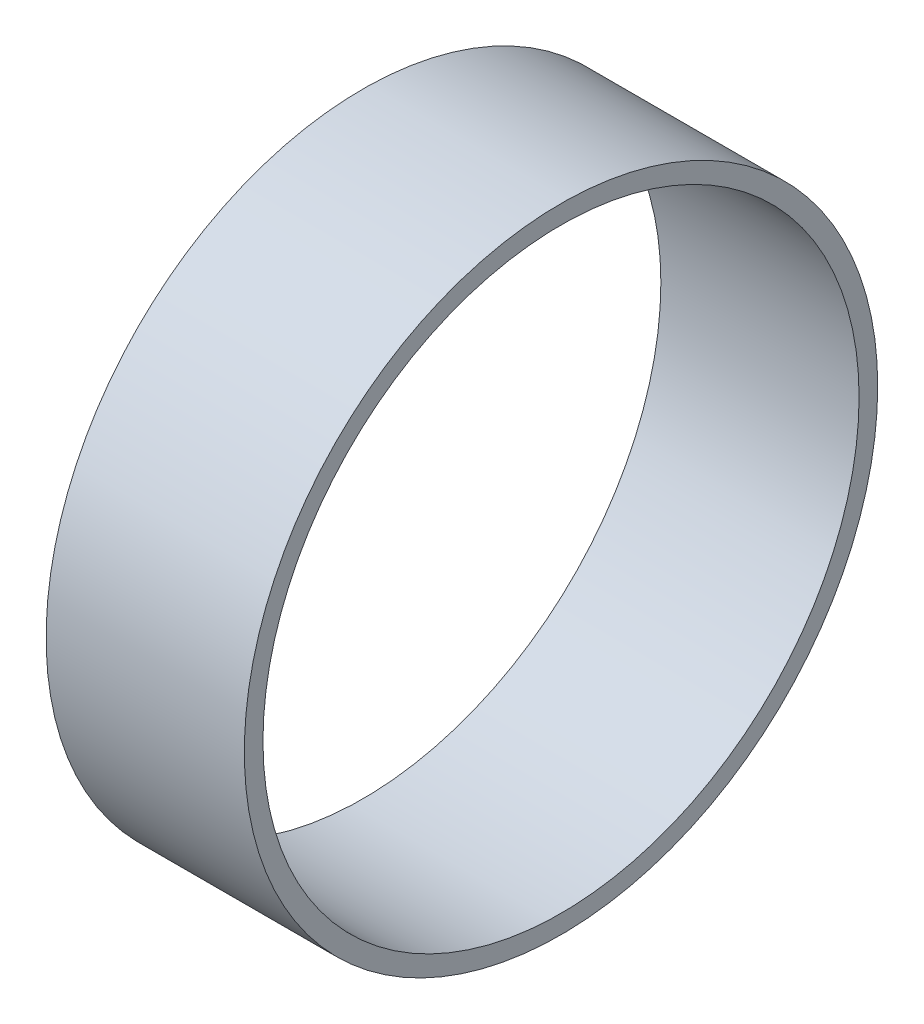
ISO-10303-21;
HEADER;
FILE_DESCRIPTION(('STEP AP214'),'2;1');
FILE_NAME('part.step','',(''),(''),'','','');
FILE_SCHEMA(('AUTOMOTIVE_DESIGN { 1 0 10303 214 1 1 1 1 }'));
ENDSEC;
DATA;
#1=APPLICATION_CONTEXT('core data for automotive mechanical design processes');
#2=APPLICATION_PROTOCOL_DEFINITION('international standard','automotive_design',2000,#1);
#3=PRODUCT_CONTEXT('',#1,'mechanical');
#4=PRODUCT('Part','Part','',(#3));
#5=PRODUCT_RELATED_PRODUCT_CATEGORY('part','',(#4));
#6=PRODUCT_DEFINITION_FORMATION('','',#4);
#7=PRODUCT_DEFINITION_CONTEXT('part definition',#1,'design');
#8=PRODUCT_DEFINITION('design','',#6,#7);
#9=PRODUCT_DEFINITION_SHAPE('','',#8);
#10=(LENGTH_UNIT() NAMED_UNIT(*) SI_UNIT(.MILLI.,.METRE.));
#11=(NAMED_UNIT(*) PLANE_ANGLE_UNIT() SI_UNIT($,.RADIAN.));
#12=(NAMED_UNIT(*) SI_UNIT($,.STERADIAN.) SOLID_ANGLE_UNIT());
#13=UNCERTAINTY_MEASURE_WITH_UNIT(LENGTH_MEASURE(1.E-05),#10,'distance_accuracy_value','');
#14=(GEOMETRIC_REPRESENTATION_CONTEXT(3) GLOBAL_UNCERTAINTY_ASSIGNED_CONTEXT((#13)) GLOBAL_UNIT_ASSIGNED_CONTEXT((#10,
#11,#12)) REPRESENTATION_CONTEXT('',''));
#15=CARTESIAN_POINT('',(0.,0.,0.));
#16=DIRECTION('',(0.,0.,1.));
#17=DIRECTION('',(1.,0.,0.));
#18=AXIS2_PLACEMENT_3D('',#15,#16,#17);
#19=CARTESIAN_POINT('',(33.782,0.,0.));
#20=DIRECTION('',(1.,0.,0.));
#21=DIRECTION('',(0.,0.,-1.));
#22=AXIS2_PLACEMENT_3D('',#19,#20,#21);
#23=PLANE('',#22);
#24=CARTESIAN_POINT('',(33.782,0.,0.));
#25=DIRECTION('',(1.,0.,0.));
#26=DIRECTION('',(0.,0.,-1.));
#27=AXIS2_PLACEMENT_3D('',#24,#25,#26);
#28=CIRCLE('',#27,53.975);
#29=CARTESIAN_POINT('',(33.782,0.,-53.975));
#30=VERTEX_POINT('',#29);
#31=EDGE_CURVE('E10',#30,#30,#28,.T.);
#32=ORIENTED_EDGE('',*,*,#31,.T.);
#33=EDGE_LOOP('',(#32));
#34=FACE_BOUND('',#33,.T.);
#35=CARTESIAN_POINT('',(33.782,0.,0.));
#36=DIRECTION('',(1.,0.,0.));
#37=DIRECTION('',(0.,0.,-1.));
#38=AXIS2_PLACEMENT_3D('',#35,#36,#37);
#39=CIRCLE('',#38,50.8);
#40=CARTESIAN_POINT('',(33.782,0.,-50.8));
#41=VERTEX_POINT('',#40);
#42=EDGE_CURVE('E42',#41,#41,#39,.T.);
#43=ORIENTED_EDGE('',*,*,#42,.F.);
#44=EDGE_LOOP('',(#43));
#45=FACE_BOUND('',#44,.T.);
#46=ADVANCED_FACE('F31',(#34,#45),#23,.T.);
#47=CARTESIAN_POINT('',(0.,0.,0.));
#48=DIRECTION('',(1.,0.,0.));
#49=DIRECTION('',(0.,0.,-1.));
#50=AXIS2_PLACEMENT_3D('',#47,#48,#49);
#51=PLANE('',#50);
#52=CARTESIAN_POINT('',(0.,0.,0.));
#53=DIRECTION('',(1.,0.,0.));
#54=DIRECTION('',(0.,0.,-1.));
#55=AXIS2_PLACEMENT_3D('',#52,#53,#54);
#56=CIRCLE('',#55,53.975);
#57=CARTESIAN_POINT('',(0.,0.,-53.975));
#58=VERTEX_POINT('',#57);
#59=EDGE_CURVE('E35',#58,#58,#56,.T.);
#60=ORIENTED_EDGE('',*,*,#59,.F.);
#61=EDGE_LOOP('',(#60));
#62=FACE_BOUND('',#61,.T.);
#63=CARTESIAN_POINT('',(0.,0.,0.));
#64=DIRECTION('',(1.,0.,0.));
#65=DIRECTION('',(0.,0.,-1.));
#66=AXIS2_PLACEMENT_3D('',#63,#64,#65);
#67=CIRCLE('',#66,50.8);
#68=CARTESIAN_POINT('',(0.,0.,-50.8));
#69=VERTEX_POINT('',#68);
#70=EDGE_CURVE('E44',#69,#69,#67,.T.);
#71=ORIENTED_EDGE('',*,*,#70,.T.);
#72=EDGE_LOOP('',(#71));
#73=FACE_BOUND('',#72,.T.);
#74=ADVANCED_FACE('F54',(#62,#73),#51,.F.);
#75=CARTESIAN_POINT('',(33.782,0.,0.));
#76=DIRECTION('',(-1.,0.,0.));
#77=DIRECTION('',(0.,0.,1.));
#78=AXIS2_PLACEMENT_3D('',#75,#76,#77);
#79=CYLINDRICAL_SURFACE('',#78,53.975);
#80=ORIENTED_EDGE('',*,*,#31,.F.);
#81=EDGE_LOOP('',(#80));
#82=FACE_BOUND('',#81,.T.);
#83=ORIENTED_EDGE('',*,*,#59,.T.);
#84=EDGE_LOOP('',(#83));
#85=FACE_BOUND('',#84,.T.);
#86=ADVANCED_FACE('F33',(#82,#85),#79,.T.);
#87=CARTESIAN_POINT('',(33.782,0.,0.));
#88=DIRECTION('',(-1.,0.,0.));
#89=DIRECTION('',(0.,0.,1.));
#90=AXIS2_PLACEMENT_3D('',#87,#88,#89);
#91=CYLINDRICAL_SURFACE('',#90,50.8);
#92=ORIENTED_EDGE('',*,*,#42,.T.);
#93=EDGE_LOOP('',(#92));
#94=FACE_BOUND('',#93,.T.);
#95=ORIENTED_EDGE('',*,*,#70,.F.);
#96=EDGE_LOOP('',(#95));
#97=FACE_BOUND('',#96,.T.);
#98=ADVANCED_FACE('F50',(#94,#97),#91,.F.);
#99=CLOSED_SHELL('',(#46,#74,#86,#98));
#100=MANIFOLD_SOLID_BREP('B2',#99);
#101=ADVANCED_BREP_SHAPE_REPRESENTATION('',(#18,#100),#14);
#102=SHAPE_DEFINITION_REPRESENTATION(#9,#101);
ENDSEC;
END-ISO-10303-21;
